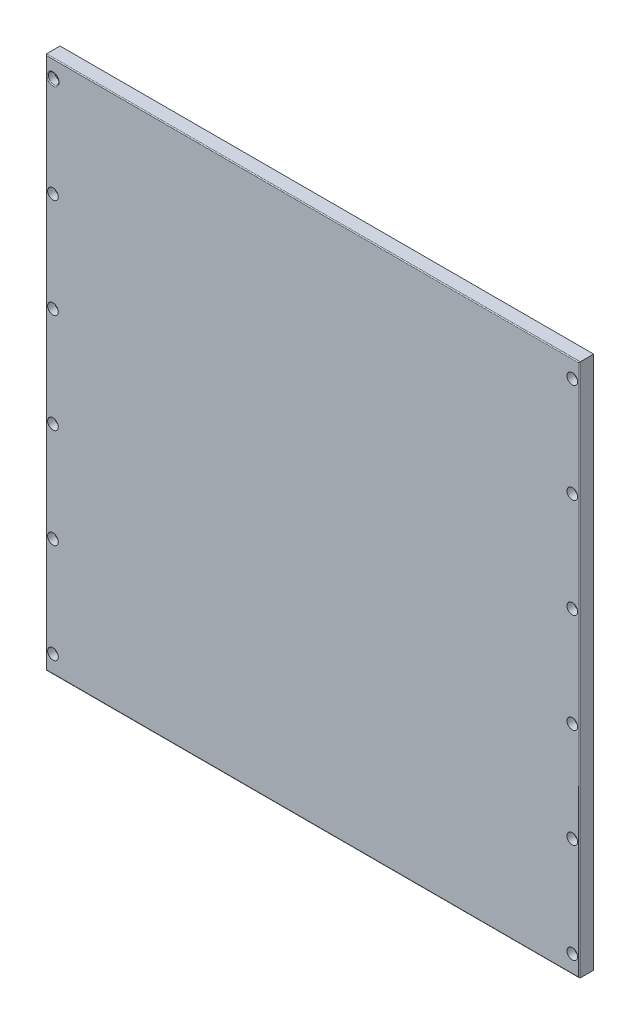
ISO-10303-21;
HEADER;
FILE_DESCRIPTION(('STEP AP214'),'2;1');
FILE_NAME('part.step','',(''),(''),'','','');
FILE_SCHEMA(('AUTOMOTIVE_DESIGN { 1 0 10303 214 1 1 1 1 }'));
ENDSEC;
DATA;
#1=APPLICATION_CONTEXT('core data for automotive mechanical design processes');
#2=APPLICATION_PROTOCOL_DEFINITION('international standard','automotive_design',2000,#1);
#3=PRODUCT_CONTEXT('',#1,'mechanical');
#4=PRODUCT('Part','Part','',(#3));
#5=PRODUCT_RELATED_PRODUCT_CATEGORY('part','',(#4));
#6=PRODUCT_DEFINITION_FORMATION('','',#4);
#7=PRODUCT_DEFINITION_CONTEXT('part definition',#1,'design');
#8=PRODUCT_DEFINITION('design','',#6,#7);
#9=PRODUCT_DEFINITION_SHAPE('','',#8);
#10=(LENGTH_UNIT() NAMED_UNIT(*) SI_UNIT(.MILLI.,.METRE.));
#11=(NAMED_UNIT(*) PLANE_ANGLE_UNIT() SI_UNIT($,.RADIAN.));
#12=(NAMED_UNIT(*) SI_UNIT($,.STERADIAN.) SOLID_ANGLE_UNIT());
#13=UNCERTAINTY_MEASURE_WITH_UNIT(LENGTH_MEASURE(1.E-05),#10,'distance_accuracy_value','');
#14=(GEOMETRIC_REPRESENTATION_CONTEXT(3) GLOBAL_UNCERTAINTY_ASSIGNED_CONTEXT((#13)) GLOBAL_UNIT_ASSIGNED_CONTEXT((#10,
#11,#12)) REPRESENTATION_CONTEXT('',''));
#15=CARTESIAN_POINT('',(0.,0.,0.));
#16=DIRECTION('',(0.,0.,1.));
#17=DIRECTION('',(1.,0.,0.));
#18=AXIS2_PLACEMENT_3D('',#15,#16,#17);
#19=CARTESIAN_POINT('',(0.,0.,8.));
#20=DIRECTION('',(1.,0.,0.));
#21=DIRECTION('',(0.,0.,-1.));
#22=AXIS2_PLACEMENT_3D('',#19,#20,#21);
#23=PLANE('',#22);
#24=DIRECTION('',(0.,0.,-1.));
#25=VECTOR('',#24,1.);
#26=CARTESIAN_POINT('',(0.,0.,8.));
#27=LINE('',#26,#25);
#28=CARTESIAN_POINT('',(0.,0.,7.5));
#29=VERTEX_POINT('',#28);
#30=CARTESIAN_POINT('',(0.,0.,0.));
#31=VERTEX_POINT('',#30);
#32=EDGE_CURVE('E94',#29,#31,#27,.T.);
#33=ORIENTED_EDGE('',*,*,#32,.F.);
#34=DIRECTION('',(0.,-1.,0.));
#35=VECTOR('',#34,1.);
#36=CARTESIAN_POINT('',(0.,0.,7.5));
#37=LINE('',#36,#35);
#38=CARTESIAN_POINT('',(0.,300.,7.5));
#39=VERTEX_POINT('',#38);
#40=EDGE_CURVE('E43',#29,#39,#37,.F.);
#41=ORIENTED_EDGE('',*,*,#40,.T.);
#42=DIRECTION('',(0.,0.,-1.));
#43=VECTOR('',#42,1.);
#44=CARTESIAN_POINT('',(0.,300.,8.));
#45=LINE('',#44,#43);
#46=CARTESIAN_POINT('',(0.,300.,0.));
#47=VERTEX_POINT('',#46);
#48=EDGE_CURVE('E114',#39,#47,#45,.T.);
#49=ORIENTED_EDGE('',*,*,#48,.T.);
#50=DIRECTION('',(0.,-1.,0.));
#51=VECTOR('',#50,1.);
#52=CARTESIAN_POINT('',(0.,0.,0.));
#53=LINE('',#52,#51);
#54=EDGE_CURVE('E109',#47,#31,#53,.T.);
#55=ORIENTED_EDGE('',*,*,#54,.T.);
#56=EDGE_LOOP('',(#33,#41,#49,#55));
#57=FACE_BOUND('',#56,.T.);
#58=ADVANCED_FACE('F34',(#57),#23,.F.);
#59=CARTESIAN_POINT('',(0.,0.,8.));
#60=DIRECTION('',(0.,1.,0.));
#61=DIRECTION('',(0.,0.,1.));
#62=AXIS2_PLACEMENT_3D('',#59,#60,#61);
#63=PLANE('',#62);
#64=DIRECTION('',(0.,0.,-1.));
#65=VECTOR('',#64,1.);
#66=CARTESIAN_POINT('',(300.,0.,8.));
#67=LINE('',#66,#65);
#68=CARTESIAN_POINT('',(300.,0.,7.5));
#69=VERTEX_POINT('',#68);
#70=CARTESIAN_POINT('',(300.,0.,0.));
#71=VERTEX_POINT('',#70);
#72=EDGE_CURVE('E103',#69,#71,#67,.T.);
#73=ORIENTED_EDGE('',*,*,#72,.F.);
#74=DIRECTION('',(1.,0.,0.));
#75=VECTOR('',#74,1.);
#76=CARTESIAN_POINT('',(0.,0.,7.5));
#77=LINE('',#76,#75);
#78=EDGE_CURVE('E51',#69,#29,#77,.F.);
#79=ORIENTED_EDGE('',*,*,#78,.T.);
#80=ORIENTED_EDGE('',*,*,#32,.T.);
#81=DIRECTION('',(1.,0.,0.));
#82=VECTOR('',#81,1.);
#83=CARTESIAN_POINT('',(0.,0.,0.));
#84=LINE('',#83,#82);
#85=EDGE_CURVE('E97',#31,#71,#84,.T.);
#86=ORIENTED_EDGE('',*,*,#85,.T.);
#87=EDGE_LOOP('',(#73,#79,#80,#86));
#88=FACE_BOUND('',#87,.T.);
#89=ADVANCED_FACE('F96',(#88),#63,.F.);
#90=CARTESIAN_POINT('',(300.,0.,8.));
#91=DIRECTION('',(-1.,0.,0.));
#92=DIRECTION('',(0.,0.,1.));
#93=AXIS2_PLACEMENT_3D('',#90,#91,#92);
#94=PLANE('',#93);
#95=DIRECTION('',(0.,0.,-1.));
#96=VECTOR('',#95,1.);
#97=CARTESIAN_POINT('',(300.,300.,8.));
#98=LINE('',#97,#96);
#99=CARTESIAN_POINT('',(300.,300.,7.5));
#100=VERTEX_POINT('',#99);
#101=CARTESIAN_POINT('',(300.,300.,0.));
#102=VERTEX_POINT('',#101);
#103=EDGE_CURVE('E127',#100,#102,#98,.T.);
#104=ORIENTED_EDGE('',*,*,#103,.F.);
#105=DIRECTION('',(0.,1.,0.));
#106=VECTOR('',#105,1.);
#107=CARTESIAN_POINT('',(300.,0.,7.5));
#108=LINE('',#107,#106);
#109=EDGE_CURVE('E59',#100,#69,#108,.F.);
#110=ORIENTED_EDGE('',*,*,#109,.T.);
#111=ORIENTED_EDGE('',*,*,#72,.T.);
#112=DIRECTION('',(0.,1.,0.));
#113=VECTOR('',#112,1.);
#114=CARTESIAN_POINT('',(300.,0.,0.));
#115=LINE('',#114,#113);
#116=EDGE_CURVE('E111',#71,#102,#115,.T.);
#117=ORIENTED_EDGE('',*,*,#116,.T.);
#118=EDGE_LOOP('',(#104,#110,#111,#117));
#119=FACE_BOUND('',#118,.T.);
#120=ADVANCED_FACE('F352',(#119),#94,.F.);
#121=CARTESIAN_POINT('',(0.,300.,8.));
#122=DIRECTION('',(0.,-1.,0.));
#123=DIRECTION('',(0.,0.,-1.));
#124=AXIS2_PLACEMENT_3D('',#121,#122,#123);
#125=PLANE('',#124);
#126=ORIENTED_EDGE('',*,*,#48,.F.);
#127=DIRECTION('',(-1.,0.,0.));
#128=VECTOR('',#127,1.);
#129=CARTESIAN_POINT('',(0.,300.,7.5));
#130=LINE('',#129,#128);
#131=EDGE_CURVE('E146',#39,#100,#130,.F.);
#132=ORIENTED_EDGE('',*,*,#131,.T.);
#133=ORIENTED_EDGE('',*,*,#103,.T.);
#134=DIRECTION('',(-1.,0.,0.));
#135=VECTOR('',#134,1.);
#136=CARTESIAN_POINT('',(0.,300.,0.));
#137=LINE('',#136,#135);
#138=EDGE_CURVE('E124',#102,#47,#137,.T.);
#139=ORIENTED_EDGE('',*,*,#138,.T.);
#140=EDGE_LOOP('',(#126,#132,#133,#139));
#141=FACE_BOUND('',#140,.T.);
#142=ADVANCED_FACE('F323',(#141),#125,.F.);
#143=CARTESIAN_POINT('',(0.,0.,8.));
#144=DIRECTION('',(0.,0.,-1.));
#145=DIRECTION('',(-1.,0.,0.));
#146=AXIS2_PLACEMENT_3D('',#143,#144,#145);
#147=PLANE('',#146);
#148=CARTESIAN_POINT('',(296.,9.99999999999995,8.));
#149=DIRECTION('',(0.,0.,1.));
#150=DIRECTION('',(1.,0.,0.));
#151=AXIS2_PLACEMENT_3D('',#148,#149,#150);
#152=CIRCLE('',#151,3.);
#153=CARTESIAN_POINT('',(299.,9.99999999999995,8.));
#154=VERTEX_POINT('',#153);
#155=EDGE_CURVE('E208',#154,#154,#152,.T.);
#156=ORIENTED_EDGE('',*,*,#155,.F.);
#157=EDGE_LOOP('',(#156));
#158=FACE_BOUND('',#157,.T.);
#159=CARTESIAN_POINT('',(296.,66.,8.));
#160=DIRECTION('',(0.,0.,1.));
#161=DIRECTION('',(1.,0.,0.));
#162=AXIS2_PLACEMENT_3D('',#159,#160,#161);
#163=CIRCLE('',#162,3.);
#164=CARTESIAN_POINT('',(299.,66.,8.));
#165=VERTEX_POINT('',#164);
#166=EDGE_CURVE('E215',#165,#165,#163,.T.);
#167=ORIENTED_EDGE('',*,*,#166,.F.);
#168=EDGE_LOOP('',(#167));
#169=FACE_BOUND('',#168,.T.);
#170=CARTESIAN_POINT('',(296.,122.,8.));
#171=DIRECTION('',(0.,0.,1.));
#172=DIRECTION('',(1.,0.,0.));
#173=AXIS2_PLACEMENT_3D('',#170,#171,#172);
#174=CIRCLE('',#173,3.);
#175=CARTESIAN_POINT('',(299.,122.,8.));
#176=VERTEX_POINT('',#175);
#177=EDGE_CURVE('E221',#176,#176,#174,.T.);
#178=ORIENTED_EDGE('',*,*,#177,.F.);
#179=EDGE_LOOP('',(#178));
#180=FACE_BOUND('',#179,.T.);
#181=CARTESIAN_POINT('',(296.,178.,8.));
#182=DIRECTION('',(0.,0.,1.));
#183=DIRECTION('',(1.,0.,0.));
#184=AXIS2_PLACEMENT_3D('',#181,#182,#183);
#185=CIRCLE('',#184,3.);
#186=CARTESIAN_POINT('',(299.,178.,8.));
#187=VERTEX_POINT('',#186);
#188=EDGE_CURVE('E227',#187,#187,#185,.T.);
#189=ORIENTED_EDGE('',*,*,#188,.F.);
#190=EDGE_LOOP('',(#189));
#191=FACE_BOUND('',#190,.T.);
#192=CARTESIAN_POINT('',(296.,234.,8.));
#193=DIRECTION('',(0.,0.,1.));
#194=DIRECTION('',(1.,0.,0.));
#195=AXIS2_PLACEMENT_3D('',#192,#193,#194);
#196=CIRCLE('',#195,3.);
#197=CARTESIAN_POINT('',(299.,234.,8.));
#198=VERTEX_POINT('',#197);
#199=EDGE_CURVE('E233',#198,#198,#196,.T.);
#200=ORIENTED_EDGE('',*,*,#199,.F.);
#201=EDGE_LOOP('',(#200));
#202=FACE_BOUND('',#201,.T.);
#203=CARTESIAN_POINT('',(4.,178.,8.));
#204=DIRECTION('',(0.,0.,1.));
#205=DIRECTION('',(1.,0.,0.));
#206=AXIS2_PLACEMENT_3D('',#203,#204,#205);
#207=CIRCLE('',#206,3.);
#208=CARTESIAN_POINT('',(7.,178.,8.));
#209=VERTEX_POINT('',#208);
#210=EDGE_CURVE('E185',#209,#209,#207,.T.);
#211=ORIENTED_EDGE('',*,*,#210,.F.);
#212=EDGE_LOOP('',(#211));
#213=FACE_BOUND('',#212,.T.);
#214=CARTESIAN_POINT('',(4.,122.,8.));
#215=DIRECTION('',(0.,0.,1.));
#216=DIRECTION('',(1.,0.,0.));
#217=AXIS2_PLACEMENT_3D('',#214,#215,#216);
#218=CIRCLE('',#217,3.);
#219=CARTESIAN_POINT('',(7.,122.,8.));
#220=VERTEX_POINT('',#219);
#221=EDGE_CURVE('E178',#220,#220,#218,.T.);
#222=ORIENTED_EDGE('',*,*,#221,.F.);
#223=EDGE_LOOP('',(#222));
#224=FACE_BOUND('',#223,.T.);
#225=CARTESIAN_POINT('',(296.,290.,8.));
#226=DIRECTION('',(0.,0.,1.));
#227=DIRECTION('',(1.,0.,0.));
#228=AXIS2_PLACEMENT_3D('',#225,#226,#227);
#229=CIRCLE('',#228,3.);
#230=CARTESIAN_POINT('',(299.,290.,8.));
#231=VERTEX_POINT('',#230);
#232=EDGE_CURVE('E196',#231,#231,#229,.T.);
#233=ORIENTED_EDGE('',*,*,#232,.F.);
#234=EDGE_LOOP('',(#233));
#235=FACE_BOUND('',#234,.T.);
#236=CARTESIAN_POINT('',(4.,9.99999999999995,8.));
#237=DIRECTION('',(0.,0.,1.));
#238=DIRECTION('',(1.,0.,0.));
#239=AXIS2_PLACEMENT_3D('',#236,#237,#238);
#240=CIRCLE('',#239,3.);
#241=CARTESIAN_POINT('',(7.,9.99999999999995,8.));
#242=VERTEX_POINT('',#241);
#243=EDGE_CURVE('E203',#242,#242,#240,.T.);
#244=ORIENTED_EDGE('',*,*,#243,.F.);
#245=EDGE_LOOP('',(#244));
#246=FACE_BOUND('',#245,.T.);
#247=CARTESIAN_POINT('',(4.,66.,8.));
#248=DIRECTION('',(0.,0.,1.));
#249=DIRECTION('',(1.,0.,0.));
#250=AXIS2_PLACEMENT_3D('',#247,#248,#249);
#251=CIRCLE('',#250,3.);
#252=CARTESIAN_POINT('',(7.,66.,8.));
#253=VERTEX_POINT('',#252);
#254=EDGE_CURVE('E190',#253,#253,#251,.T.);
#255=ORIENTED_EDGE('',*,*,#254,.F.);
#256=EDGE_LOOP('',(#255));
#257=FACE_BOUND('',#256,.T.);
#258=CARTESIAN_POINT('',(4.,234.,8.));
#259=DIRECTION('',(0.,0.,1.));
#260=DIRECTION('',(1.,0.,0.));
#261=AXIS2_PLACEMENT_3D('',#258,#259,#260);
#262=CIRCLE('',#261,3.);
#263=CARTESIAN_POINT('',(7.,234.,8.));
#264=VERTEX_POINT('',#263);
#265=EDGE_CURVE('E172',#264,#264,#262,.T.);
#266=ORIENTED_EDGE('',*,*,#265,.F.);
#267=EDGE_LOOP('',(#266));
#268=FACE_BOUND('',#267,.T.);
#269=DIRECTION('',(-1.,0.,0.));
#270=VECTOR('',#269,1.);
#271=CARTESIAN_POINT('',(0.,299.5,8.));
#272=LINE('',#271,#270);
#273=CARTESIAN_POINT('',(299.5,299.5,8.));
#274=VERTEX_POINT('',#273);
#275=CARTESIAN_POINT('',(0.5,299.5,8.));
#276=VERTEX_POINT('',#275);
#277=EDGE_CURVE('E140',#274,#276,#272,.T.);
#278=ORIENTED_EDGE('',*,*,#277,.T.);
#279=DIRECTION('',(0.,-1.,0.));
#280=VECTOR('',#279,1.);
#281=CARTESIAN_POINT('',(0.5,0.,8.));
#282=LINE('',#281,#280);
#283=CARTESIAN_POINT('',(0.5,290.,8.));
#284=VERTEX_POINT('',#283);
#285=EDGE_CURVE('E143',#276,#284,#282,.T.);
#286=ORIENTED_EDGE('',*,*,#285,.T.);
#287=CARTESIAN_POINT('',(4.,290.,8.));
#288=DIRECTION('',(0.,0.,-1.));
#289=DIRECTION('',(-1.,0.,0.));
#290=AXIS2_PLACEMENT_3D('',#287,#288,#289);
#291=CIRCLE('',#290,3.5);
#292=CARTESIAN_POINT('',(7.5,290.,8.));
#293=VERTEX_POINT('',#292);
#294=EDGE_CURVE('E102',#284,#293,#291,.T.);
#295=ORIENTED_EDGE('',*,*,#294,.T.);
#296=CARTESIAN_POINT('',(4.,290.,8.));
#297=DIRECTION('',(0.,0.,-1.));
#298=DIRECTION('',(-1.,0.,0.));
#299=AXIS2_PLACEMENT_3D('',#296,#297,#298);
#300=CIRCLE('',#299,3.5);
#301=EDGE_CURVE('E131',#293,#284,#300,.T.);
#302=ORIENTED_EDGE('',*,*,#301,.T.);
#303=DIRECTION('',(0.,-1.,0.));
#304=VECTOR('',#303,1.);
#305=CARTESIAN_POINT('',(0.5,0.,8.));
#306=LINE('',#305,#304);
#307=CARTESIAN_POINT('',(0.5,0.5,8.));
#308=VERTEX_POINT('',#307);
#309=EDGE_CURVE('E134',#284,#308,#306,.T.);
#310=ORIENTED_EDGE('',*,*,#309,.T.);
#311=DIRECTION('',(1.,0.,0.));
#312=VECTOR('',#311,1.);
#313=CARTESIAN_POINT('',(0.,0.5,8.));
#314=LINE('',#313,#312);
#315=CARTESIAN_POINT('',(299.5,0.5,8.));
#316=VERTEX_POINT('',#315);
#317=EDGE_CURVE('E136',#308,#316,#314,.T.);
#318=ORIENTED_EDGE('',*,*,#317,.T.);
#319=DIRECTION('',(0.,1.,0.));
#320=VECTOR('',#319,1.);
#321=CARTESIAN_POINT('',(299.5,0.,8.));
#322=LINE('',#321,#320);
#323=EDGE_CURVE('E138',#316,#274,#322,.T.);
#324=ORIENTED_EDGE('',*,*,#323,.T.);
#325=EDGE_LOOP('',(#278,#286,#295,#302,#310,#318,#324));
#326=FACE_BOUND('',#325,.T.);
#327=ADVANCED_FACE('F320',(#158,#169,#180,#191,#202,#213,#224,#235,#246,#257,#268,#326),#147,.F.);
#328=CARTESIAN_POINT('',(0.,0.,0.));
#329=DIRECTION('',(0.,0.,-1.));
#330=DIRECTION('',(-1.,0.,0.));
#331=AXIS2_PLACEMENT_3D('',#328,#329,#330);
#332=PLANE('',#331);
#333=CARTESIAN_POINT('',(296.,9.99999999999995,0.));
#334=DIRECTION('',(0.,0.,-1.));
#335=DIRECTION('',(-1.,0.,0.));
#336=AXIS2_PLACEMENT_3D('',#333,#334,#335);
#337=CIRCLE('',#336,1.5);
#338=CARTESIAN_POINT('',(294.5,9.99999999999995,0.));
#339=VERTEX_POINT('',#338);
#340=EDGE_CURVE('E274',#339,#339,#337,.F.);
#341=ORIENTED_EDGE('',*,*,#340,.T.);
#342=EDGE_LOOP('',(#341));
#343=FACE_BOUND('',#342,.T.);
#344=CARTESIAN_POINT('',(296.,66.,0.));
#345=DIRECTION('',(0.,0.,-1.));
#346=DIRECTION('',(-1.,0.,0.));
#347=AXIS2_PLACEMENT_3D('',#344,#345,#346);
#348=CIRCLE('',#347,1.5);
#349=CARTESIAN_POINT('',(294.5,66.,0.));
#350=VERTEX_POINT('',#349);
#351=EDGE_CURVE('E280',#350,#350,#348,.F.);
#352=ORIENTED_EDGE('',*,*,#351,.T.);
#353=EDGE_LOOP('',(#352));
#354=FACE_BOUND('',#353,.T.);
#355=CARTESIAN_POINT('',(296.,122.,0.));
#356=DIRECTION('',(0.,0.,-1.));
#357=DIRECTION('',(-1.,0.,0.));
#358=AXIS2_PLACEMENT_3D('',#355,#356,#357);
#359=CIRCLE('',#358,1.5);
#360=CARTESIAN_POINT('',(294.5,122.,0.));
#361=VERTEX_POINT('',#360);
#362=EDGE_CURVE('E286',#361,#361,#359,.F.);
#363=ORIENTED_EDGE('',*,*,#362,.T.);
#364=EDGE_LOOP('',(#363));
#365=FACE_BOUND('',#364,.T.);
#366=CARTESIAN_POINT('',(296.,178.,0.));
#367=DIRECTION('',(0.,0.,-1.));
#368=DIRECTION('',(-1.,0.,0.));
#369=AXIS2_PLACEMENT_3D('',#366,#367,#368);
#370=CIRCLE('',#369,1.5);
#371=CARTESIAN_POINT('',(294.5,178.,0.));
#372=VERTEX_POINT('',#371);
#373=EDGE_CURVE('E292',#372,#372,#370,.F.);
#374=ORIENTED_EDGE('',*,*,#373,.T.);
#375=EDGE_LOOP('',(#374));
#376=FACE_BOUND('',#375,.T.);
#377=CARTESIAN_POINT('',(296.,234.,0.));
#378=DIRECTION('',(0.,0.,-1.));
#379=DIRECTION('',(-1.,0.,0.));
#380=AXIS2_PLACEMENT_3D('',#377,#378,#379);
#381=CIRCLE('',#380,1.5);
#382=CARTESIAN_POINT('',(294.5,234.,0.));
#383=VERTEX_POINT('',#382);
#384=EDGE_CURVE('E298',#383,#383,#381,.F.);
#385=ORIENTED_EDGE('',*,*,#384,.T.);
#386=EDGE_LOOP('',(#385));
#387=FACE_BOUND('',#386,.T.);
#388=CARTESIAN_POINT('',(4.,178.,0.));
#389=DIRECTION('',(0.,0.,-1.));
#390=DIRECTION('',(-1.,0.,0.));
#391=AXIS2_PLACEMENT_3D('',#388,#389,#390);
#392=CIRCLE('',#391,1.5);
#393=CARTESIAN_POINT('',(2.5,178.,0.));
#394=VERTEX_POINT('',#393);
#395=EDGE_CURVE('E251',#394,#394,#392,.F.);
#396=ORIENTED_EDGE('',*,*,#395,.T.);
#397=EDGE_LOOP('',(#396));
#398=FACE_BOUND('',#397,.T.);
#399=CARTESIAN_POINT('',(4.,122.,0.));
#400=DIRECTION('',(0.,0.,-1.));
#401=DIRECTION('',(-1.,0.,0.));
#402=AXIS2_PLACEMENT_3D('',#399,#400,#401);
#403=CIRCLE('',#402,1.5);
#404=CARTESIAN_POINT('',(2.5,122.,0.));
#405=VERTEX_POINT('',#404);
#406=EDGE_CURVE('E244',#405,#405,#403,.F.);
#407=ORIENTED_EDGE('',*,*,#406,.T.);
#408=EDGE_LOOP('',(#407));
#409=FACE_BOUND('',#408,.T.);
#410=CARTESIAN_POINT('',(296.,290.,0.));
#411=DIRECTION('',(0.,0.,-1.));
#412=DIRECTION('',(-1.,0.,0.));
#413=AXIS2_PLACEMENT_3D('',#410,#411,#412);
#414=CIRCLE('',#413,1.5);
#415=CARTESIAN_POINT('',(294.5,290.,0.));
#416=VERTEX_POINT('',#415);
#417=EDGE_CURVE('E262',#416,#416,#414,.F.);
#418=ORIENTED_EDGE('',*,*,#417,.T.);
#419=EDGE_LOOP('',(#418));
#420=FACE_BOUND('',#419,.T.);
#421=CARTESIAN_POINT('',(4.,9.99999999999995,0.));
#422=DIRECTION('',(0.,0.,-1.));
#423=DIRECTION('',(-1.,0.,0.));
#424=AXIS2_PLACEMENT_3D('',#421,#422,#423);
#425=CIRCLE('',#424,1.5);
#426=CARTESIAN_POINT('',(2.5,9.99999999999995,0.));
#427=VERTEX_POINT('',#426);
#428=EDGE_CURVE('E269',#427,#427,#425,.F.);
#429=ORIENTED_EDGE('',*,*,#428,.T.);
#430=EDGE_LOOP('',(#429));
#431=FACE_BOUND('',#430,.T.);
#432=CARTESIAN_POINT('',(4.,66.,0.));
#433=DIRECTION('',(0.,0.,-1.));
#434=DIRECTION('',(-1.,0.,0.));
#435=AXIS2_PLACEMENT_3D('',#432,#433,#434);
#436=CIRCLE('',#435,1.5);
#437=CARTESIAN_POINT('',(2.5,66.,0.));
#438=VERTEX_POINT('',#437);
#439=EDGE_CURVE('E256',#438,#438,#436,.F.);
#440=ORIENTED_EDGE('',*,*,#439,.T.);
#441=EDGE_LOOP('',(#440));
#442=FACE_BOUND('',#441,.T.);
#443=CARTESIAN_POINT('',(4.,234.,0.));
#444=DIRECTION('',(0.,0.,-1.));
#445=DIRECTION('',(-1.,0.,0.));
#446=AXIS2_PLACEMENT_3D('',#443,#444,#445);
#447=CIRCLE('',#446,1.5);
#448=CARTESIAN_POINT('',(2.5,234.,0.));
#449=VERTEX_POINT('',#448);
#450=EDGE_CURVE('E238',#449,#449,#447,.F.);
#451=ORIENTED_EDGE('',*,*,#450,.T.);
#452=EDGE_LOOP('',(#451));
#453=FACE_BOUND('',#452,.T.);
#454=CARTESIAN_POINT('',(4.,290.,0.));
#455=DIRECTION('',(0.,0.,-1.));
#456=DIRECTION('',(-1.,0.,0.));
#457=AXIS2_PLACEMENT_3D('',#454,#455,#456);
#458=CIRCLE('',#457,1.5);
#459=CARTESIAN_POINT('',(2.5,290.,0.));
#460=VERTEX_POINT('',#459);
#461=EDGE_CURVE('E162',#460,#460,#458,.F.);
#462=ORIENTED_EDGE('',*,*,#461,.T.);
#463=EDGE_LOOP('',(#462));
#464=FACE_BOUND('',#463,.T.);
#465=ORIENTED_EDGE('',*,*,#54,.F.);
#466=ORIENTED_EDGE('',*,*,#138,.F.);
#467=ORIENTED_EDGE('',*,*,#116,.F.);
#468=ORIENTED_EDGE('',*,*,#85,.F.);
#469=EDGE_LOOP('',(#465,#466,#467,#468));
#470=FACE_BOUND('',#469,.T.);
#471=ADVANCED_FACE('F107',(#343,#354,#365,#376,#387,#398,#409,#420,#431,#442,#453,#464,#470),
#332,.T.);
#472=CARTESIAN_POINT('',(4.,290.,4.));
#473=DIRECTION('',(0.,0.,1.));
#474=DIRECTION('',(1.,0.,0.));
#475=AXIS2_PLACEMENT_3D('',#472,#473,#474);
#476=CYLINDRICAL_SURFACE('',#475,3.);
#477=CARTESIAN_POINT('',(4.,290.,7.5));
#478=DIRECTION('',(0.,0.,-1.));
#479=DIRECTION('',(-1.,0.,0.));
#480=AXIS2_PLACEMENT_3D('',#477,#478,#479);
#481=CIRCLE('',#480,3.);
#482=CARTESIAN_POINT('',(0.999999999999997,290.,7.5));
#483=VERTEX_POINT('',#482);
#484=EDGE_CURVE('E11',#483,#483,#481,.F.);
#485=ORIENTED_EDGE('',*,*,#484,.T.);
#486=EDGE_LOOP('',(#485));
#487=FACE_BOUND('',#486,.T.);
#488=CARTESIAN_POINT('',(4.,290.,4.));
#489=DIRECTION('',(0.,0.,1.));
#490=DIRECTION('',(1.,0.,0.));
#491=AXIS2_PLACEMENT_3D('',#488,#489,#490);
#492=CIRCLE('',#491,3.);
#493=CARTESIAN_POINT('',(7.,290.,4.));
#494=VERTEX_POINT('',#493);
#495=EDGE_CURVE('E116',#494,#494,#492,.T.);
#496=ORIENTED_EDGE('',*,*,#495,.F.);
#497=EDGE_LOOP('',(#496));
#498=FACE_BOUND('',#497,.T.);
#499=ADVANCED_FACE('F382',(#487,#498),#476,.F.);
#500=CARTESIAN_POINT('',(4.,290.,4.));
#501=DIRECTION('',(0.,0.,1.));
#502=DIRECTION('',(1.,0.,0.));
#503=AXIS2_PLACEMENT_3D('',#500,#501,#502);
#504=PLANE('',#503);
#505=CARTESIAN_POINT('',(4.,290.,4.));
#506=DIRECTION('',(0.,0.,1.));
#507=DIRECTION('',(1.,0.,0.));
#508=AXIS2_PLACEMENT_3D('',#505,#506,#507);
#509=CIRCLE('',#508,1.5);
#510=CARTESIAN_POINT('',(5.5,290.,4.));
#511=VERTEX_POINT('',#510);
#512=EDGE_CURVE('E119',#511,#511,#509,.T.);
#513=ORIENTED_EDGE('',*,*,#512,.F.);
#514=EDGE_LOOP('',(#513));
#515=FACE_BOUND('',#514,.T.);
#516=ORIENTED_EDGE('',*,*,#495,.T.);
#517=EDGE_LOOP('',(#516));
#518=FACE_BOUND('',#517,.T.);
#519=ADVANCED_FACE('F376',(#515,#518),#504,.T.);
#520=CARTESIAN_POINT('',(4.,290.,-0.00100000000000013));
#521=DIRECTION('',(0.,0.,1.));
#522=DIRECTION('',(1.,0.,0.));
#523=AXIS2_PLACEMENT_3D('',#520,#521,#522);
#524=CYLINDRICAL_SURFACE('',#523,1.5);
#525=ORIENTED_EDGE('',*,*,#461,.F.);
#526=EDGE_LOOP('',(#525));
#527=FACE_BOUND('',#526,.T.);
#528=ORIENTED_EDGE('',*,*,#512,.T.);
#529=EDGE_LOOP('',(#528));
#530=FACE_BOUND('',#529,.T.);
#531=ADVANCED_FACE('F372',(#527,#530),#524,.F.);
#532=CARTESIAN_POINT('',(0.,0.5,7.5));
#533=DIRECTION('',(1.,0.,0.));
#534=DIRECTION('',(0.,0.,-1.));
#535=AXIS2_PLACEMENT_3D('',#532,#533,#534);
#536=CYLINDRICAL_SURFACE('',#535,0.5);
#537=CARTESIAN_POINT('',(0.5,0.5,7.5));
#538=DIRECTION('',(0.707106781186547,-0.707106781186547,0.));
#539=DIRECTION('',(-0.707106781186547,-0.707106781186547,0.));
#540=AXIS2_PLACEMENT_3D('',#537,#538,#539);
#541=ELLIPSE('',#540,0.707106781186547,0.5);
#542=EDGE_CURVE('E156',#29,#308,#541,.F.);
#543=ORIENTED_EDGE('',*,*,#542,.F.);
#544=ORIENTED_EDGE('',*,*,#78,.F.);
#545=CARTESIAN_POINT('',(299.5,0.5,7.5));
#546=DIRECTION('',(0.707106781186547,0.707106781186547,0.));
#547=DIRECTION('',(0.707106781186547,-0.707106781186547,0.));
#548=AXIS2_PLACEMENT_3D('',#545,#546,#547);
#549=ELLIPSE('',#548,0.707106781186547,0.5);
#550=EDGE_CURVE('E38',#316,#69,#549,.T.);
#551=ORIENTED_EDGE('',*,*,#550,.F.);
#552=ORIENTED_EDGE('',*,*,#317,.F.);
#553=EDGE_LOOP('',(#543,#544,#551,#552));
#554=FACE_BOUND('',#553,.T.);
#555=ADVANCED_FACE('F349',(#554),#536,.T.);
#556=CARTESIAN_POINT('',(299.5,0.,7.5));
#557=DIRECTION('',(0.,1.,0.));
#558=DIRECTION('',(0.,0.,1.));
#559=AXIS2_PLACEMENT_3D('',#556,#557,#558);
#560=CYLINDRICAL_SURFACE('',#559,0.5);
#561=ORIENTED_EDGE('',*,*,#550,.T.);
#562=ORIENTED_EDGE('',*,*,#109,.F.);
#563=CARTESIAN_POINT('',(299.5,299.5,7.5));
#564=DIRECTION('',(-0.707106781186547,0.707106781186547,0.));
#565=DIRECTION('',(0.707106781186547,0.707106781186547,0.));
#566=AXIS2_PLACEMENT_3D('',#563,#564,#565);
#567=ELLIPSE('',#566,0.707106781186547,0.5);
#568=EDGE_CURVE('E154',#274,#100,#567,.T.);
#569=ORIENTED_EDGE('',*,*,#568,.F.);
#570=ORIENTED_EDGE('',*,*,#323,.F.);
#571=EDGE_LOOP('',(#561,#562,#569,#570));
#572=FACE_BOUND('',#571,.T.);
#573=ADVANCED_FACE('F350',(#572),#560,.T.);
#574=CARTESIAN_POINT('',(0.5,0.,7.5));
#575=DIRECTION('',(0.,-1.,0.));
#576=DIRECTION('',(0.,0.,-1.));
#577=AXIS2_PLACEMENT_3D('',#574,#575,#576);
#578=CYLINDRICAL_SURFACE('',#577,0.5);
#579=ORIENTED_EDGE('',*,*,#309,.F.);
#580=ORIENTED_EDGE('',*,*,#285,.F.);
#581=CARTESIAN_POINT('',(0.5,299.5,7.5));
#582=DIRECTION('',(-0.707106781186547,-0.707106781186547,0.));
#583=DIRECTION('',(0.707106781186547,-0.707106781186547,0.));
#584=AXIS2_PLACEMENT_3D('',#581,#582,#583);
#585=ELLIPSE('',#584,0.707106781186547,0.5);
#586=EDGE_CURVE('E152',#39,#276,#585,.F.);
#587=ORIENTED_EDGE('',*,*,#586,.F.);
#588=ORIENTED_EDGE('',*,*,#40,.F.);
#589=ORIENTED_EDGE('',*,*,#542,.T.);
#590=EDGE_LOOP('',(#579,#580,#587,#588,#589));
#591=FACE_BOUND('',#590,.T.);
#592=ADVANCED_FACE('F345',(#591),#578,.T.);
#593=CARTESIAN_POINT('',(0.,299.5,7.5));
#594=DIRECTION('',(-1.,0.,0.));
#595=DIRECTION('',(0.,0.,1.));
#596=AXIS2_PLACEMENT_3D('',#593,#594,#595);
#597=CYLINDRICAL_SURFACE('',#596,0.5);
#598=ORIENTED_EDGE('',*,*,#568,.T.);
#599=ORIENTED_EDGE('',*,*,#131,.F.);
#600=ORIENTED_EDGE('',*,*,#586,.T.);
#601=ORIENTED_EDGE('',*,*,#277,.F.);
#602=EDGE_LOOP('',(#598,#599,#600,#601));
#603=FACE_BOUND('',#602,.T.);
#604=ADVANCED_FACE('F342',(#603),#597,.T.);
#605=CARTESIAN_POINT('',(4.,290.,7.5));
#606=DIRECTION('',(0.,0.,-1.));
#607=DIRECTION('',(-1.,0.,0.));
#608=AXIS2_PLACEMENT_3D('',#605,#606,#607);
#609=TOROIDAL_SURFACE('',#608,3.5,0.5);
#610=ORIENTED_EDGE('',*,*,#294,.F.);
#611=ORIENTED_EDGE('',*,*,#301,.F.);
#612=EDGE_LOOP('',(#610,#611));
#613=FACE_BOUND('',#612,.T.);
#614=ORIENTED_EDGE('',*,*,#484,.F.);
#615=EDGE_LOOP('',(#614));
#616=FACE_BOUND('',#615,.T.);
#617=ADVANCED_FACE('F36',(#613,#616),#609,.T.);
#618=CARTESIAN_POINT('',(4.,234.,4.));
#619=DIRECTION('',(0.,0.,1.));
#620=DIRECTION('',(1.,0.,0.));
#621=AXIS2_PLACEMENT_3D('',#618,#619,#620);
#622=CYLINDRICAL_SURFACE('',#621,3.);
#623=CARTESIAN_POINT('',(4.,234.,4.));
#624=DIRECTION('',(0.,0.,1.));
#625=DIRECTION('',(1.,0.,0.));
#626=AXIS2_PLACEMENT_3D('',#623,#624,#625);
#627=CIRCLE('',#626,3.);
#628=CARTESIAN_POINT('',(7.,234.,4.));
#629=VERTEX_POINT('',#628);
#630=EDGE_CURVE('E155',#629,#629,#627,.T.);
#631=ORIENTED_EDGE('',*,*,#630,.F.);
#632=EDGE_LOOP('',(#631));
#633=FACE_BOUND('',#632,.T.);
#634=ORIENTED_EDGE('',*,*,#265,.T.);
#635=EDGE_LOOP('',(#634));
#636=FACE_BOUND('',#635,.T.);
#637=ADVANCED_FACE('F387',(#633,#636),#622,.F.);
#638=CARTESIAN_POINT('',(4.,234.,4.));
#639=DIRECTION('',(0.,0.,1.));
#640=DIRECTION('',(1.,0.,0.));
#641=AXIS2_PLACEMENT_3D('',#638,#639,#640);
#642=PLANE('',#641);
#643=CARTESIAN_POINT('',(4.,234.,4.));
#644=DIRECTION('',(0.,0.,1.));
#645=DIRECTION('',(1.,0.,0.));
#646=AXIS2_PLACEMENT_3D('',#643,#644,#645);
#647=CIRCLE('',#646,1.5);
#648=CARTESIAN_POINT('',(5.5,234.,4.));
#649=VERTEX_POINT('',#648);
#650=EDGE_CURVE('E212',#649,#649,#647,.T.);
#651=ORIENTED_EDGE('',*,*,#650,.F.);
#652=EDGE_LOOP('',(#651));
#653=FACE_BOUND('',#652,.T.);
#654=ORIENTED_EDGE('',*,*,#630,.T.);
#655=EDGE_LOOP('',(#654));
#656=FACE_BOUND('',#655,.T.);
#657=ADVANCED_FACE('F427',(#653,#656),#642,.T.);
#658=CARTESIAN_POINT('',(4.,66.,4.));
#659=DIRECTION('',(0.,0.,1.));
#660=DIRECTION('',(1.,0.,0.));
#661=AXIS2_PLACEMENT_3D('',#658,#659,#660);
#662=CYLINDRICAL_SURFACE('',#661,3.);
#663=CARTESIAN_POINT('',(4.,66.,4.));
#664=DIRECTION('',(0.,0.,1.));
#665=DIRECTION('',(1.,0.,0.));
#666=AXIS2_PLACEMENT_3D('',#663,#664,#665);
#667=CIRCLE('',#666,3.);
#668=CARTESIAN_POINT('',(7.,66.,4.));
#669=VERTEX_POINT('',#668);
#670=EDGE_CURVE('E182',#669,#669,#667,.T.);
#671=ORIENTED_EDGE('',*,*,#670,.F.);
#672=EDGE_LOOP('',(#671));
#673=FACE_BOUND('',#672,.T.);
#674=ORIENTED_EDGE('',*,*,#254,.T.);
#675=EDGE_LOOP('',(#674));
#676=FACE_BOUND('',#675,.T.);
#677=ADVANCED_FACE('F430',(#673,#676),#662,.F.);
#678=CARTESIAN_POINT('',(4.,66.,4.));
#679=DIRECTION('',(0.,0.,1.));
#680=DIRECTION('',(1.,0.,0.));
#681=AXIS2_PLACEMENT_3D('',#678,#679,#680);
#682=PLANE('',#681);
#683=CARTESIAN_POINT('',(4.,66.,4.));
#684=DIRECTION('',(0.,0.,1.));
#685=DIRECTION('',(1.,0.,0.));
#686=AXIS2_PLACEMENT_3D('',#683,#684,#685);
#687=CIRCLE('',#686,1.5);
#688=CARTESIAN_POINT('',(5.5,66.,4.));
#689=VERTEX_POINT('',#688);
#690=EDGE_CURVE('E248',#689,#689,#687,.T.);
#691=ORIENTED_EDGE('',*,*,#690,.F.);
#692=EDGE_LOOP('',(#691));
#693=FACE_BOUND('',#692,.T.);
#694=ORIENTED_EDGE('',*,*,#670,.T.);
#695=EDGE_LOOP('',(#694));
#696=FACE_BOUND('',#695,.T.);
#697=ADVANCED_FACE('F542',(#693,#696),#682,.T.);
#698=CARTESIAN_POINT('',(4.,9.99999999999995,4.));
#699=DIRECTION('',(0.,0.,1.));
#700=DIRECTION('',(1.,0.,0.));
#701=AXIS2_PLACEMENT_3D('',#698,#699,#700);
#702=CYLINDRICAL_SURFACE('',#701,3.);
#703=CARTESIAN_POINT('',(4.,9.99999999999995,4.));
#704=DIRECTION('',(0.,0.,1.));
#705=DIRECTION('',(1.,0.,0.));
#706=AXIS2_PLACEMENT_3D('',#703,#704,#705);
#707=CIRCLE('',#706,3.);
#708=CARTESIAN_POINT('',(7.,9.99999999999995,4.));
#709=VERTEX_POINT('',#708);
#710=EDGE_CURVE('E193',#709,#709,#707,.T.);
#711=ORIENTED_EDGE('',*,*,#710,.F.);
#712=EDGE_LOOP('',(#711));
#713=FACE_BOUND('',#712,.T.);
#714=ORIENTED_EDGE('',*,*,#243,.T.);
#715=EDGE_LOOP('',(#714));
#716=FACE_BOUND('',#715,.T.);
#717=ADVANCED_FACE('F552',(#713,#716),#702,.F.);
#718=CARTESIAN_POINT('',(4.,9.99999999999995,4.));
#719=DIRECTION('',(0.,0.,1.));
#720=DIRECTION('',(1.,0.,0.));
#721=AXIS2_PLACEMENT_3D('',#718,#719,#720);
#722=PLANE('',#721);
#723=CARTESIAN_POINT('',(4.,9.99999999999995,4.));
#724=DIRECTION('',(0.,0.,1.));
#725=DIRECTION('',(1.,0.,0.));
#726=AXIS2_PLACEMENT_3D('',#723,#724,#725);
#727=CIRCLE('',#726,1.5);
#728=CARTESIAN_POINT('',(5.5,9.99999999999995,4.));
#729=VERTEX_POINT('',#728);
#730=EDGE_CURVE('E259',#729,#729,#727,.T.);
#731=ORIENTED_EDGE('',*,*,#730,.F.);
#732=EDGE_LOOP('',(#731));
#733=FACE_BOUND('',#732,.T.);
#734=ORIENTED_EDGE('',*,*,#710,.T.);
#735=EDGE_LOOP('',(#734));
#736=FACE_BOUND('',#735,.T.);
#737=ADVANCED_FACE('F562',(#733,#736),#722,.T.);
#738=CARTESIAN_POINT('',(296.,290.,4.));
#739=DIRECTION('',(0.,0.,1.));
#740=DIRECTION('',(1.,0.,0.));
#741=AXIS2_PLACEMENT_3D('',#738,#739,#740);
#742=CYLINDRICAL_SURFACE('',#741,3.);
#743=CARTESIAN_POINT('',(296.,290.,4.));
#744=DIRECTION('',(0.,0.,1.));
#745=DIRECTION('',(1.,0.,0.));
#746=AXIS2_PLACEMENT_3D('',#743,#744,#745);
#747=CIRCLE('',#746,3.);
#748=CARTESIAN_POINT('',(299.,290.,4.));
#749=VERTEX_POINT('',#748);
#750=EDGE_CURVE('E199',#749,#749,#747,.T.);
#751=ORIENTED_EDGE('',*,*,#750,.F.);
#752=EDGE_LOOP('',(#751));
#753=FACE_BOUND('',#752,.T.);
#754=ORIENTED_EDGE('',*,*,#232,.T.);
#755=EDGE_LOOP('',(#754));
#756=FACE_BOUND('',#755,.T.);
#757=ADVANCED_FACE('F572',(#753,#756),#742,.F.);
#758=CARTESIAN_POINT('',(296.,290.,4.));
#759=DIRECTION('',(0.,0.,1.));
#760=DIRECTION('',(1.,0.,0.));
#761=AXIS2_PLACEMENT_3D('',#758,#759,#760);
#762=PLANE('',#761);
#763=CARTESIAN_POINT('',(296.,290.,4.));
#764=DIRECTION('',(0.,0.,1.));
#765=DIRECTION('',(1.,0.,0.));
#766=AXIS2_PLACEMENT_3D('',#763,#764,#765);
#767=CIRCLE('',#766,1.5);
#768=CARTESIAN_POINT('',(297.5,290.,4.));
#769=VERTEX_POINT('',#768);
#770=EDGE_CURVE('E265',#769,#769,#767,.T.);
#771=ORIENTED_EDGE('',*,*,#770,.F.);
#772=EDGE_LOOP('',(#771));
#773=FACE_BOUND('',#772,.T.);
#774=ORIENTED_EDGE('',*,*,#750,.T.);
#775=EDGE_LOOP('',(#774));
#776=FACE_BOUND('',#775,.T.);
#777=ADVANCED_FACE('F582',(#773,#776),#762,.T.);
#778=CARTESIAN_POINT('',(4.,122.,4.));
#779=DIRECTION('',(0.,0.,1.));
#780=DIRECTION('',(1.,0.,0.));
#781=AXIS2_PLACEMENT_3D('',#778,#779,#780);
#782=CYLINDRICAL_SURFACE('',#781,3.);
#783=CARTESIAN_POINT('',(4.,122.,4.));
#784=DIRECTION('',(0.,0.,1.));
#785=DIRECTION('',(1.,0.,0.));
#786=AXIS2_PLACEMENT_3D('',#783,#784,#785);
#787=CIRCLE('',#786,3.);
#788=CARTESIAN_POINT('',(7.,122.,4.));
#789=VERTEX_POINT('',#788);
#790=EDGE_CURVE('E181',#789,#789,#787,.T.);
#791=ORIENTED_EDGE('',*,*,#790,.F.);
#792=EDGE_LOOP('',(#791));
#793=FACE_BOUND('',#792,.T.);
#794=ORIENTED_EDGE('',*,*,#221,.T.);
#795=EDGE_LOOP('',(#794));
#796=FACE_BOUND('',#795,.T.);
#797=ADVANCED_FACE('F592',(#793,#796),#782,.F.);
#798=CARTESIAN_POINT('',(4.,122.,4.));
#799=DIRECTION('',(0.,0.,1.));
#800=DIRECTION('',(1.,0.,0.));
#801=AXIS2_PLACEMENT_3D('',#798,#799,#800);
#802=PLANE('',#801);
#803=CARTESIAN_POINT('',(4.,122.,4.));
#804=DIRECTION('',(0.,0.,1.));
#805=DIRECTION('',(1.,0.,0.));
#806=AXIS2_PLACEMENT_3D('',#803,#804,#805);
#807=CIRCLE('',#806,1.5);
#808=CARTESIAN_POINT('',(5.5,122.,4.));
#809=VERTEX_POINT('',#808);
#810=EDGE_CURVE('E247',#809,#809,#807,.T.);
#811=ORIENTED_EDGE('',*,*,#810,.F.);
#812=EDGE_LOOP('',(#811));
#813=FACE_BOUND('',#812,.T.);
#814=ORIENTED_EDGE('',*,*,#790,.T.);
#815=EDGE_LOOP('',(#814));
#816=FACE_BOUND('',#815,.T.);
#817=ADVANCED_FACE('F602',(#813,#816),#802,.T.);
#818=CARTESIAN_POINT('',(4.,178.,4.));
#819=DIRECTION('',(0.,0.,1.));
#820=DIRECTION('',(1.,0.,0.));
#821=AXIS2_PLACEMENT_3D('',#818,#819,#820);
#822=CYLINDRICAL_SURFACE('',#821,3.);
#823=CARTESIAN_POINT('',(4.,178.,4.));
#824=DIRECTION('',(0.,0.,1.));
#825=DIRECTION('',(1.,0.,0.));
#826=AXIS2_PLACEMENT_3D('',#823,#824,#825);
#827=CIRCLE('',#826,3.);
#828=CARTESIAN_POINT('',(7.,178.,4.));
#829=VERTEX_POINT('',#828);
#830=EDGE_CURVE('E175',#829,#829,#827,.T.);
#831=ORIENTED_EDGE('',*,*,#830,.F.);
#832=EDGE_LOOP('',(#831));
#833=FACE_BOUND('',#832,.T.);
#834=ORIENTED_EDGE('',*,*,#210,.T.);
#835=EDGE_LOOP('',(#834));
#836=FACE_BOUND('',#835,.T.);
#837=ADVANCED_FACE('F612',(#833,#836),#822,.F.);
#838=CARTESIAN_POINT('',(4.,178.,4.));
#839=DIRECTION('',(0.,0.,1.));
#840=DIRECTION('',(1.,0.,0.));
#841=AXIS2_PLACEMENT_3D('',#838,#839,#840);
#842=PLANE('',#841);
#843=CARTESIAN_POINT('',(4.,178.,4.));
#844=DIRECTION('',(0.,0.,1.));
#845=DIRECTION('',(1.,0.,0.));
#846=AXIS2_PLACEMENT_3D('',#843,#844,#845);
#847=CIRCLE('',#846,1.5);
#848=CARTESIAN_POINT('',(5.5,178.,4.));
#849=VERTEX_POINT('',#848);
#850=EDGE_CURVE('E241',#849,#849,#847,.T.);
#851=ORIENTED_EDGE('',*,*,#850,.F.);
#852=EDGE_LOOP('',(#851));
#853=FACE_BOUND('',#852,.T.);
#854=ORIENTED_EDGE('',*,*,#830,.T.);
#855=EDGE_LOOP('',(#854));
#856=FACE_BOUND('',#855,.T.);
#857=ADVANCED_FACE('F316',(#853,#856),#842,.T.);
#858=CARTESIAN_POINT('',(296.,234.,4.));
#859=DIRECTION('',(0.,0.,1.));
#860=DIRECTION('',(1.,0.,0.));
#861=AXIS2_PLACEMENT_3D('',#858,#859,#860);
#862=CYLINDRICAL_SURFACE('',#861,3.);
#863=CARTESIAN_POINT('',(296.,234.,4.));
#864=DIRECTION('',(0.,0.,1.));
#865=DIRECTION('',(1.,0.,0.));
#866=AXIS2_PLACEMENT_3D('',#863,#864,#865);
#867=CIRCLE('',#866,3.);
#868=CARTESIAN_POINT('',(299.,234.,4.));
#869=VERTEX_POINT('',#868);
#870=EDGE_CURVE('E200',#869,#869,#867,.T.);
#871=ORIENTED_EDGE('',*,*,#870,.F.);
#872=EDGE_LOOP('',(#871));
#873=FACE_BOUND('',#872,.T.);
#874=ORIENTED_EDGE('',*,*,#199,.T.);
#875=EDGE_LOOP('',(#874));
#876=FACE_BOUND('',#875,.T.);
#877=ADVANCED_FACE('F310',(#873,#876),#862,.F.);
#878=CARTESIAN_POINT('',(296.,234.,4.));
#879=DIRECTION('',(0.,0.,1.));
#880=DIRECTION('',(1.,0.,0.));
#881=AXIS2_PLACEMENT_3D('',#878,#879,#880);
#882=PLANE('',#881);
#883=CARTESIAN_POINT('',(296.,234.,4.));
#884=DIRECTION('',(0.,0.,1.));
#885=DIRECTION('',(1.,0.,0.));
#886=AXIS2_PLACEMENT_3D('',#883,#884,#885);
#887=CIRCLE('',#886,1.5);
#888=CARTESIAN_POINT('',(297.5,234.,4.));
#889=VERTEX_POINT('',#888);
#890=EDGE_CURVE('E266',#889,#889,#887,.T.);
#891=ORIENTED_EDGE('',*,*,#890,.F.);
#892=EDGE_LOOP('',(#891));
#893=FACE_BOUND('',#892,.T.);
#894=ORIENTED_EDGE('',*,*,#870,.T.);
#895=EDGE_LOOP('',(#894));
#896=FACE_BOUND('',#895,.T.);
#897=ADVANCED_FACE('F306',(#893,#896),#882,.T.);
#898=CARTESIAN_POINT('',(296.,178.,4.));
#899=DIRECTION('',(0.,0.,1.));
#900=DIRECTION('',(1.,0.,0.));
#901=AXIS2_PLACEMENT_3D('',#898,#899,#900);
#902=CYLINDRICAL_SURFACE('',#901,3.);
#903=CARTESIAN_POINT('',(296.,178.,4.));
#904=DIRECTION('',(0.,0.,1.));
#905=DIRECTION('',(1.,0.,0.));
#906=AXIS2_PLACEMENT_3D('',#903,#904,#905);
#907=CIRCLE('',#906,3.);
#908=CARTESIAN_POINT('',(299.,178.,4.));
#909=VERTEX_POINT('',#908);
#910=EDGE_CURVE('E230',#909,#909,#907,.T.);
#911=ORIENTED_EDGE('',*,*,#910,.F.);
#912=EDGE_LOOP('',(#911));
#913=FACE_BOUND('',#912,.T.);
#914=ORIENTED_EDGE('',*,*,#188,.T.);
#915=EDGE_LOOP('',(#914));
#916=FACE_BOUND('',#915,.T.);
#917=ADVANCED_FACE('F309',(#913,#916),#902,.F.);
#918=CARTESIAN_POINT('',(296.,178.,4.));
#919=DIRECTION('',(0.,0.,1.));
#920=DIRECTION('',(1.,0.,0.));
#921=AXIS2_PLACEMENT_3D('',#918,#919,#920);
#922=PLANE('',#921);
#923=CARTESIAN_POINT('',(296.,178.,4.));
#924=DIRECTION('',(0.,0.,1.));
#925=DIRECTION('',(1.,0.,0.));
#926=AXIS2_PLACEMENT_3D('',#923,#924,#925);
#927=CIRCLE('',#926,1.5);
#928=CARTESIAN_POINT('',(297.5,178.,4.));
#929=VERTEX_POINT('',#928);
#930=EDGE_CURVE('E295',#929,#929,#927,.T.);
#931=ORIENTED_EDGE('',*,*,#930,.F.);
#932=EDGE_LOOP('',(#931));
#933=FACE_BOUND('',#932,.T.);
#934=ORIENTED_EDGE('',*,*,#910,.T.);
#935=EDGE_LOOP('',(#934));
#936=FACE_BOUND('',#935,.T.);
#937=ADVANCED_FACE('F652',(#933,#936),#922,.T.);
#938=CARTESIAN_POINT('',(296.,122.,4.));
#939=DIRECTION('',(0.,0.,1.));
#940=DIRECTION('',(1.,0.,0.));
#941=AXIS2_PLACEMENT_3D('',#938,#939,#940);
#942=CYLINDRICAL_SURFACE('',#941,3.);
#943=CARTESIAN_POINT('',(296.,122.,4.));
#944=DIRECTION('',(0.,0.,1.));
#945=DIRECTION('',(1.,0.,0.));
#946=AXIS2_PLACEMENT_3D('',#943,#944,#945);
#947=CIRCLE('',#946,3.);
#948=CARTESIAN_POINT('',(299.,122.,4.));
#949=VERTEX_POINT('',#948);
#950=EDGE_CURVE('E224',#949,#949,#947,.T.);
#951=ORIENTED_EDGE('',*,*,#950,.F.);
#952=EDGE_LOOP('',(#951));
#953=FACE_BOUND('',#952,.T.);
#954=ORIENTED_EDGE('',*,*,#177,.T.);
#955=EDGE_LOOP('',(#954));
#956=FACE_BOUND('',#955,.T.);
#957=ADVANCED_FACE('F662',(#953,#956),#942,.F.);
#958=CARTESIAN_POINT('',(296.,122.,4.));
#959=DIRECTION('',(0.,0.,1.));
#960=DIRECTION('',(1.,0.,0.));
#961=AXIS2_PLACEMENT_3D('',#958,#959,#960);
#962=PLANE('',#961);
#963=CARTESIAN_POINT('',(296.,122.,4.));
#964=DIRECTION('',(0.,0.,1.));
#965=DIRECTION('',(1.,0.,0.));
#966=AXIS2_PLACEMENT_3D('',#963,#964,#965);
#967=CIRCLE('',#966,1.5);
#968=CARTESIAN_POINT('',(297.5,122.,4.));
#969=VERTEX_POINT('',#968);
#970=EDGE_CURVE('E289',#969,#969,#967,.T.);
#971=ORIENTED_EDGE('',*,*,#970,.F.);
#972=EDGE_LOOP('',(#971));
#973=FACE_BOUND('',#972,.T.);
#974=ORIENTED_EDGE('',*,*,#950,.T.);
#975=EDGE_LOOP('',(#974));
#976=FACE_BOUND('',#975,.T.);
#977=ADVANCED_FACE('F672',(#973,#976),#962,.T.);
#978=CARTESIAN_POINT('',(296.,66.,4.));
#979=DIRECTION('',(0.,0.,1.));
#980=DIRECTION('',(1.,0.,0.));
#981=AXIS2_PLACEMENT_3D('',#978,#979,#980);
#982=CYLINDRICAL_SURFACE('',#981,3.);
#983=CARTESIAN_POINT('',(296.,66.,4.));
#984=DIRECTION('',(0.,0.,1.));
#985=DIRECTION('',(1.,0.,0.));
#986=AXIS2_PLACEMENT_3D('',#983,#984,#985);
#987=CIRCLE('',#986,3.);
#988=CARTESIAN_POINT('',(299.,66.,4.));
#989=VERTEX_POINT('',#988);
#990=EDGE_CURVE('E218',#989,#989,#987,.T.);
#991=ORIENTED_EDGE('',*,*,#990,.F.);
#992=EDGE_LOOP('',(#991));
#993=FACE_BOUND('',#992,.T.);
#994=ORIENTED_EDGE('',*,*,#166,.T.);
#995=EDGE_LOOP('',(#994));
#996=FACE_BOUND('',#995,.T.);
#997=ADVANCED_FACE('F682',(#993,#996),#982,.F.);
#998=CARTESIAN_POINT('',(296.,66.,4.));
#999=DIRECTION('',(0.,0.,1.));
#1000=DIRECTION('',(1.,0.,0.));
#1001=AXIS2_PLACEMENT_3D('',#998,#999,#1000);
#1002=PLANE('',#1001);
#1003=CARTESIAN_POINT('',(296.,66.,4.));
#1004=DIRECTION('',(0.,0.,1.));
#1005=DIRECTION('',(1.,0.,0.));
#1006=AXIS2_PLACEMENT_3D('',#1003,#1004,#1005);
#1007=CIRCLE('',#1006,1.5);
#1008=CARTESIAN_POINT('',(297.5,66.,4.));
#1009=VERTEX_POINT('',#1008);
#1010=EDGE_CURVE('E283',#1009,#1009,#1007,.T.);
#1011=ORIENTED_EDGE('',*,*,#1010,.F.);
#1012=EDGE_LOOP('',(#1011));
#1013=FACE_BOUND('',#1012,.T.);
#1014=ORIENTED_EDGE('',*,*,#990,.T.);
#1015=EDGE_LOOP('',(#1014));
#1016=FACE_BOUND('',#1015,.T.);
#1017=ADVANCED_FACE('F692',(#1013,#1016),#1002,.T.);
#1018=CARTESIAN_POINT('',(296.,9.99999999999995,4.));
#1019=DIRECTION('',(0.,0.,1.));
#1020=DIRECTION('',(1.,0.,0.));
#1021=AXIS2_PLACEMENT_3D('',#1018,#1019,#1020);
#1022=CYLINDRICAL_SURFACE('',#1021,3.);
#1023=CARTESIAN_POINT('',(296.,9.99999999999995,4.));
#1024=DIRECTION('',(0.,0.,1.));
#1025=DIRECTION('',(1.,0.,0.));
#1026=AXIS2_PLACEMENT_3D('',#1023,#1024,#1025);
#1027=CIRCLE('',#1026,3.);
#1028=CARTESIAN_POINT('',(299.,9.99999999999995,4.));
#1029=VERTEX_POINT('',#1028);
#1030=EDGE_CURVE('E211',#1029,#1029,#1027,.T.);
#1031=ORIENTED_EDGE('',*,*,#1030,.F.);
#1032=EDGE_LOOP('',(#1031));
#1033=FACE_BOUND('',#1032,.T.);
#1034=ORIENTED_EDGE('',*,*,#155,.T.);
#1035=EDGE_LOOP('',(#1034));
#1036=FACE_BOUND('',#1035,.T.);
#1037=ADVANCED_FACE('F702',(#1033,#1036),#1022,.F.);
#1038=CARTESIAN_POINT('',(296.,9.99999999999995,4.));
#1039=DIRECTION('',(0.,0.,1.));
#1040=DIRECTION('',(1.,0.,0.));
#1041=AXIS2_PLACEMENT_3D('',#1038,#1039,#1040);
#1042=PLANE('',#1041);
#1043=CARTESIAN_POINT('',(296.,9.99999999999995,4.));
#1044=DIRECTION('',(0.,0.,1.));
#1045=DIRECTION('',(1.,0.,0.));
#1046=AXIS2_PLACEMENT_3D('',#1043,#1044,#1045);
#1047=CIRCLE('',#1046,1.5);
#1048=CARTESIAN_POINT('',(297.5,9.99999999999995,4.));
#1049=VERTEX_POINT('',#1048);
#1050=EDGE_CURVE('E277',#1049,#1049,#1047,.T.);
#1051=ORIENTED_EDGE('',*,*,#1050,.F.);
#1052=EDGE_LOOP('',(#1051));
#1053=FACE_BOUND('',#1052,.T.);
#1054=ORIENTED_EDGE('',*,*,#1030,.T.);
#1055=EDGE_LOOP('',(#1054));
#1056=FACE_BOUND('',#1055,.T.);
#1057=ADVANCED_FACE('F423',(#1053,#1056),#1042,.T.);
#1058=CARTESIAN_POINT('',(4.,234.,-0.00100000000000013));
#1059=DIRECTION('',(0.,0.,1.));
#1060=DIRECTION('',(1.,0.,0.));
#1061=AXIS2_PLACEMENT_3D('',#1058,#1059,#1060);
#1062=CYLINDRICAL_SURFACE('',#1061,1.5);
#1063=ORIENTED_EDGE('',*,*,#450,.F.);
#1064=EDGE_LOOP('',(#1063));
#1065=FACE_BOUND('',#1064,.T.);
#1066=ORIENTED_EDGE('',*,*,#650,.T.);
#1067=EDGE_LOOP('',(#1066));
#1068=FACE_BOUND('',#1067,.T.);
#1069=ADVANCED_FACE('F419',(#1065,#1068),#1062,.F.);
#1070=CARTESIAN_POINT('',(296.,9.99999999999995,-0.00100000000000013));
#1071=DIRECTION('',(0.,0.,1.));
#1072=DIRECTION('',(1.,0.,0.));
#1073=AXIS2_PLACEMENT_3D('',#1070,#1071,#1072);
#1074=CYLINDRICAL_SURFACE('',#1073,1.5);
#1075=ORIENTED_EDGE('',*,*,#340,.F.);
#1076=EDGE_LOOP('',(#1075));
#1077=FACE_BOUND('',#1076,.T.);
#1078=ORIENTED_EDGE('',*,*,#1050,.T.);
#1079=EDGE_LOOP('',(#1078));
#1080=FACE_BOUND('',#1079,.T.);
#1081=ADVANCED_FACE('F422',(#1077,#1080),#1074,.F.);
#1082=CARTESIAN_POINT('',(296.,66.,-0.00100000000000013));
#1083=DIRECTION('',(0.,0.,1.));
#1084=DIRECTION('',(1.,0.,0.));
#1085=AXIS2_PLACEMENT_3D('',#1082,#1083,#1084);
#1086=CYLINDRICAL_SURFACE('',#1085,1.5);
#1087=ORIENTED_EDGE('',*,*,#351,.F.);
#1088=EDGE_LOOP('',(#1087));
#1089=FACE_BOUND('',#1088,.T.);
#1090=ORIENTED_EDGE('',*,*,#1010,.T.);
#1091=EDGE_LOOP('',(#1090));
#1092=FACE_BOUND('',#1091,.T.);
#1093=ADVANCED_FACE('F736',(#1089,#1092),#1086,.F.);
#1094=CARTESIAN_POINT('',(296.,122.,-0.00100000000000013));
#1095=DIRECTION('',(0.,0.,1.));
#1096=DIRECTION('',(1.,0.,0.));
#1097=AXIS2_PLACEMENT_3D('',#1094,#1095,#1096);
#1098=CYLINDRICAL_SURFACE('',#1097,1.5);
#1099=ORIENTED_EDGE('',*,*,#362,.F.);
#1100=EDGE_LOOP('',(#1099));
#1101=FACE_BOUND('',#1100,.T.);
#1102=ORIENTED_EDGE('',*,*,#970,.T.);
#1103=EDGE_LOOP('',(#1102));
#1104=FACE_BOUND('',#1103,.T.);
#1105=ADVANCED_FACE('F746',(#1101,#1104),#1098,.F.);
#1106=CARTESIAN_POINT('',(296.,178.,-0.00100000000000013));
#1107=DIRECTION('',(0.,0.,1.));
#1108=DIRECTION('',(1.,0.,0.));
#1109=AXIS2_PLACEMENT_3D('',#1106,#1107,#1108);
#1110=CYLINDRICAL_SURFACE('',#1109,1.5);
#1111=ORIENTED_EDGE('',*,*,#373,.F.);
#1112=EDGE_LOOP('',(#1111));
#1113=FACE_BOUND('',#1112,.T.);
#1114=ORIENTED_EDGE('',*,*,#930,.T.);
#1115=EDGE_LOOP('',(#1114));
#1116=FACE_BOUND('',#1115,.T.);
#1117=ADVANCED_FACE('F756',(#1113,#1116),#1110,.F.);
#1118=CARTESIAN_POINT('',(296.,234.,-0.00100000000000013));
#1119=DIRECTION('',(0.,0.,1.));
#1120=DIRECTION('',(1.,0.,0.));
#1121=AXIS2_PLACEMENT_3D('',#1118,#1119,#1120);
#1122=CYLINDRICAL_SURFACE('',#1121,1.5);
#1123=ORIENTED_EDGE('',*,*,#384,.F.);
#1124=EDGE_LOOP('',(#1123));
#1125=FACE_BOUND('',#1124,.T.);
#1126=ORIENTED_EDGE('',*,*,#890,.T.);
#1127=EDGE_LOOP('',(#1126));
#1128=FACE_BOUND('',#1127,.T.);
#1129=ADVANCED_FACE('F304',(#1125,#1128),#1122,.F.);
#1130=CARTESIAN_POINT('',(4.,178.,-0.00100000000000013));
#1131=DIRECTION('',(0.,0.,1.));
#1132=DIRECTION('',(1.,0.,0.));
#1133=AXIS2_PLACEMENT_3D('',#1130,#1131,#1132);
#1134=CYLINDRICAL_SURFACE('',#1133,1.5);
#1135=ORIENTED_EDGE('',*,*,#395,.F.);
#1136=EDGE_LOOP('',(#1135));
#1137=FACE_BOUND('',#1136,.T.);
#1138=ORIENTED_EDGE('',*,*,#850,.T.);
#1139=EDGE_LOOP('',(#1138));
#1140=FACE_BOUND('',#1139,.T.);
#1141=ADVANCED_FACE('F775',(#1137,#1140),#1134,.F.);
#1142=CARTESIAN_POINT('',(4.,122.,-0.00100000000000013));
#1143=DIRECTION('',(0.,0.,1.));
#1144=DIRECTION('',(1.,0.,0.));
#1145=AXIS2_PLACEMENT_3D('',#1142,#1143,#1144);
#1146=CYLINDRICAL_SURFACE('',#1145,1.5);
#1147=ORIENTED_EDGE('',*,*,#406,.F.);
#1148=EDGE_LOOP('',(#1147));
#1149=FACE_BOUND('',#1148,.T.);
#1150=ORIENTED_EDGE('',*,*,#810,.T.);
#1151=EDGE_LOOP('',(#1150));
#1152=FACE_BOUND('',#1151,.T.);
#1153=ADVANCED_FACE('F785',(#1149,#1152),#1146,.F.);
#1154=CARTESIAN_POINT('',(296.,290.,-0.00100000000000013));
#1155=DIRECTION('',(0.,0.,1.));
#1156=DIRECTION('',(1.,0.,0.));
#1157=AXIS2_PLACEMENT_3D('',#1154,#1155,#1156);
#1158=CYLINDRICAL_SURFACE('',#1157,1.5);
#1159=ORIENTED_EDGE('',*,*,#417,.F.);
#1160=EDGE_LOOP('',(#1159));
#1161=FACE_BOUND('',#1160,.T.);
#1162=ORIENTED_EDGE('',*,*,#770,.T.);
#1163=EDGE_LOOP('',(#1162));
#1164=FACE_BOUND('',#1163,.T.);
#1165=ADVANCED_FACE('F795',(#1161,#1164),#1158,.F.);
#1166=CARTESIAN_POINT('',(4.,9.99999999999995,-0.00100000000000013));
#1167=DIRECTION('',(0.,0.,1.));
#1168=DIRECTION('',(1.,0.,0.));
#1169=AXIS2_PLACEMENT_3D('',#1166,#1167,#1168);
#1170=CYLINDRICAL_SURFACE('',#1169,1.5);
#1171=ORIENTED_EDGE('',*,*,#428,.F.);
#1172=EDGE_LOOP('',(#1171));
#1173=FACE_BOUND('',#1172,.T.);
#1174=ORIENTED_EDGE('',*,*,#730,.T.);
#1175=EDGE_LOOP('',(#1174));
#1176=FACE_BOUND('',#1175,.T.);
#1177=ADVANCED_FACE('F805',(#1173,#1176),#1170,.F.);
#1178=CARTESIAN_POINT('',(4.,66.,-0.00100000000000013));
#1179=DIRECTION('',(0.,0.,1.));
#1180=DIRECTION('',(1.,0.,0.));
#1181=AXIS2_PLACEMENT_3D('',#1178,#1179,#1180);
#1182=CYLINDRICAL_SURFACE('',#1181,1.5);
#1183=ORIENTED_EDGE('',*,*,#439,.F.);
#1184=EDGE_LOOP('',(#1183));
#1185=FACE_BOUND('',#1184,.T.);
#1186=ORIENTED_EDGE('',*,*,#690,.T.);
#1187=EDGE_LOOP('',(#1186));
#1188=FACE_BOUND('',#1187,.T.);
#1189=ADVANCED_FACE('F815',(#1185,#1188),#1182,.F.);
#1190=CLOSED_SHELL('',(#58,#89,#120,#142,#327,#471,#499,#519,#531,#555,#573,#592,#604,#617,#637,
#657,#677,#697,#717,#737,#757,#777,#797,#817,#837,#857,#877,#897,#917,#937,#957,#977,#997,#1017,
#1037,#1057,#1069,#1081,#1093,#1105,#1117,#1129,#1141,#1153,#1165,#1177,#1189));
#1191=MANIFOLD_SOLID_BREP('B2',#1190);
#1192=ADVANCED_BREP_SHAPE_REPRESENTATION('',(#18,#1191),#14);
#1193=SHAPE_DEFINITION_REPRESENTATION(#9,#1192);
ENDSEC;
END-ISO-10303-21;
